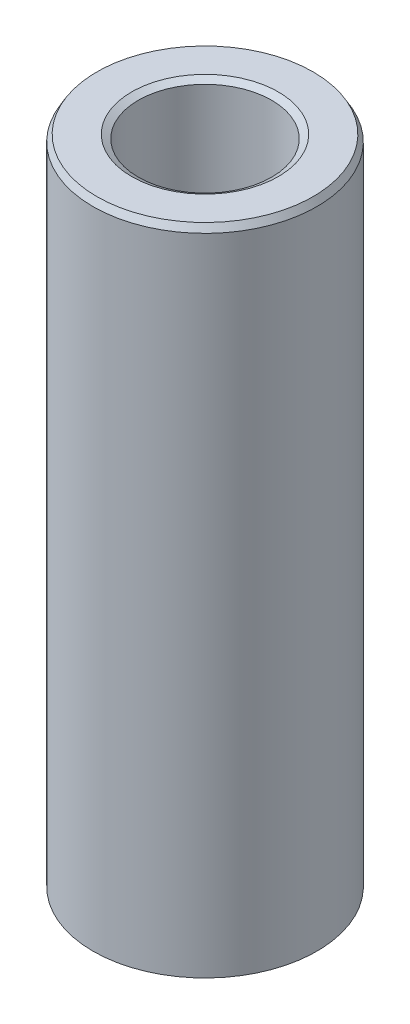
ISO-10303-21;
HEADER;
FILE_DESCRIPTION(('STEP AP214'),'2;1');
FILE_NAME('part.step','',(''),(''),'','','');
FILE_SCHEMA(('AUTOMOTIVE_DESIGN { 1 0 10303 214 1 1 1 1 }'));
ENDSEC;
DATA;
#1=APPLICATION_CONTEXT('core data for automotive mechanical design processes');
#2=APPLICATION_PROTOCOL_DEFINITION('international standard','automotive_design',2000,#1);
#3=PRODUCT_CONTEXT('',#1,'mechanical');
#4=PRODUCT('Part','Part','',(#3));
#5=PRODUCT_RELATED_PRODUCT_CATEGORY('part','',(#4));
#6=PRODUCT_DEFINITION_FORMATION('','',#4);
#7=PRODUCT_DEFINITION_CONTEXT('part definition',#1,'design');
#8=PRODUCT_DEFINITION('design','',#6,#7);
#9=PRODUCT_DEFINITION_SHAPE('','',#8);
#10=(LENGTH_UNIT() NAMED_UNIT(*) SI_UNIT(.MILLI.,.METRE.));
#11=(NAMED_UNIT(*) PLANE_ANGLE_UNIT() SI_UNIT($,.RADIAN.));
#12=(NAMED_UNIT(*) SI_UNIT($,.STERADIAN.) SOLID_ANGLE_UNIT());
#13=UNCERTAINTY_MEASURE_WITH_UNIT(LENGTH_MEASURE(1.E-05),#10,'distance_accuracy_value','');
#14=(GEOMETRIC_REPRESENTATION_CONTEXT(3) GLOBAL_UNCERTAINTY_ASSIGNED_CONTEXT((#13)) GLOBAL_UNIT_ASSIGNED_CONTEXT((#10,
#11,#12)) REPRESENTATION_CONTEXT('',''));
#15=CARTESIAN_POINT('',(0.,0.,0.));
#16=DIRECTION('',(0.,0.,1.));
#17=DIRECTION('',(1.,0.,0.));
#18=AXIS2_PLACEMENT_3D('',#15,#16,#17);
#19=CARTESIAN_POINT('',(0.,234.147937617198,0.));
#20=DIRECTION('',(0.,-1.,0.));
#21=DIRECTION('',(0.,0.,-1.));
#22=AXIS2_PLACEMENT_3D('',#19,#20,#21);
#23=CYLINDRICAL_SURFACE('',#22,40.);
#24=CARTESIAN_POINT('',(0.,1.38084321602647,0.));
#25=DIRECTION('',(0.,1.,0.));
#26=DIRECTION('',(0.,0.,1.));
#27=AXIS2_PLACEMENT_3D('',#24,#25,#26);
#28=CIRCLE('',#27,40.);
#29=CARTESIAN_POINT('',(0.,1.38084321602647,-40.));
#30=VERTEX_POINT('',#29);
#31=EDGE_CURVE('E10',#30,#30,#28,.T.);
#32=CARTESIAN_POINT('',(0.,231.756247009754,0.));
#33=DIRECTION('',(0.,1.,0.));
#34=DIRECTION('',(0.,0.,1.));
#35=AXIS2_PLACEMENT_3D('',#32,#33,#34);
#36=CIRCLE('',#35,40.);
#37=CARTESIAN_POINT('',(0.,231.756247009754,-40.));
#38=VERTEX_POINT('',#37);
#39=EDGE_CURVE('E50',#38,#38,#36,.F.);
#40=CARTESIAN_POINT('',(0.,1.38084321602647,-40.));
#41=CARTESIAN_POINT('',(0.,3.78058700554446,-40.));
#42=CARTESIAN_POINT('',(0.,6.18033079506246,-40.));
#43=CARTESIAN_POINT('',(0.,10.9798183740985,-40.));
#44=CARTESIAN_POINT('',(0.,13.3795621636165,-40.));
#45=CARTESIAN_POINT('',(0.,18.1790497426524,-40.));
#46=CARTESIAN_POINT('',(0.,20.5787935321704,-40.));
#47=CARTESIAN_POINT('',(0.,25.3782811112064,-40.));
#48=CARTESIAN_POINT('',(0.,27.7780249007244,-40.));
#49=CARTESIAN_POINT('',(0.,32.5775124797604,-40.));
#50=CARTESIAN_POINT('',(0.,34.9772562692784,-40.));
#51=CARTESIAN_POINT('',(0.,39.7767438483144,-40.));
#52=CARTESIAN_POINT('',(0.,42.1764876378324,-40.));
#53=CARTESIAN_POINT('',(0.,46.9759752168684,-40.));
#54=CARTESIAN_POINT('',(0.,49.3757190063864,-40.));
#55=CARTESIAN_POINT('',(0.,54.1752065854224,-40.));
#56=CARTESIAN_POINT('',(0.,56.5749503749404,-40.));
#57=CARTESIAN_POINT('',(0.,61.3744379539764,-40.));
#58=CARTESIAN_POINT('',(0.,63.7741817434943,-40.));
#59=CARTESIAN_POINT('',(0.,68.5736693225303,-40.));
#60=CARTESIAN_POINT('',(0.,70.9734131120483,-40.));
#61=CARTESIAN_POINT('',(0.,75.7729006910843,-40.));
#62=CARTESIAN_POINT('',(0.,78.1726444806023,-40.));
#63=CARTESIAN_POINT('',(0.,82.9721320596383,-40.));
#64=CARTESIAN_POINT('',(0.,85.3718758491563,-40.));
#65=CARTESIAN_POINT('',(0.,90.1713634281923,-40.));
#66=CARTESIAN_POINT('',(0.,92.5711072177103,-40.));
#67=CARTESIAN_POINT('',(0.,97.3705947967463,-40.));
#68=CARTESIAN_POINT('',(0.,99.7703385862643,-40.));
#69=CARTESIAN_POINT('',(0.,104.5698261653,-40.));
#70=CARTESIAN_POINT('',(0.,106.969569954818,-40.));
#71=CARTESIAN_POINT('',(0.,111.769057533854,-40.));
#72=CARTESIAN_POINT('',(0.,114.168801323372,-40.));
#73=CARTESIAN_POINT('',(0.,118.968288902408,-40.));
#74=CARTESIAN_POINT('',(0.,121.368032691926,-40.));
#75=CARTESIAN_POINT('',(0.,126.167520270962,-40.));
#76=CARTESIAN_POINT('',(0.,128.56726406048,-40.));
#77=CARTESIAN_POINT('',(0.,133.366751639516,-40.));
#78=CARTESIAN_POINT('',(0.,135.766495429034,-40.));
#79=CARTESIAN_POINT('',(0.,140.56598300807,-40.));
#80=CARTESIAN_POINT('',(0.,142.965726797588,-40.));
#81=CARTESIAN_POINT('',(0.,147.765214376624,-40.));
#82=CARTESIAN_POINT('',(0.,150.164958166142,-40.));
#83=CARTESIAN_POINT('',(0.,154.964445745178,-40.));
#84=CARTESIAN_POINT('',(0.,157.364189534696,-40.));
#85=CARTESIAN_POINT('',(0.,162.163677113732,-40.));
#86=CARTESIAN_POINT('',(0.,164.56342090325,-40.));
#87=CARTESIAN_POINT('',(0.,169.362908482286,-40.));
#88=CARTESIAN_POINT('',(0.,171.762652271804,-40.));
#89=CARTESIAN_POINT('',(0.,176.56213985084,-40.));
#90=CARTESIAN_POINT('',(0.,178.961883640358,-40.));
#91=CARTESIAN_POINT('',(0.,183.761371219394,-40.));
#92=CARTESIAN_POINT('',(0.,186.161115008912,-40.));
#93=CARTESIAN_POINT('',(0.,190.960602587948,-40.));
#94=CARTESIAN_POINT('',(0.,193.360346377466,-40.));
#95=CARTESIAN_POINT('',(0.,198.159833956502,-40.));
#96=CARTESIAN_POINT('',(0.,200.55957774602,-40.));
#97=CARTESIAN_POINT('',(0.,205.359065325056,-40.));
#98=CARTESIAN_POINT('',(0.,207.758809114574,-40.));
#99=CARTESIAN_POINT('',(0.,212.55829669361,-40.));
#100=CARTESIAN_POINT('',(0.,214.958040483128,-40.));
#101=CARTESIAN_POINT('',(0.,219.757528062164,-40.));
#102=CARTESIAN_POINT('',(0.,222.157271851682,-40.));
#103=CARTESIAN_POINT('',(0.,226.956759430718,-40.));
#104=CARTESIAN_POINT('',(0.,229.356503220236,-40.));
#105=CARTESIAN_POINT('',(0.,231.756247009754,-40.));
#106=B_SPLINE_CURVE_WITH_KNOTS('',3,(#40,#41,#42,#43,#44,#45,#46,#47,#48,#49,#50,#51,#52,#53,
#54,#55,#56,#57,#58,#59,#60,#61,#62,#63,#64,#65,#66,#67,#68,#69,#70,#71,#72,#73,#74,#75,#76,#77,
#78,#79,#80,#81,#82,#83,#84,#85,#86,#87,#88,#89,#90,#91,#92,#93,#94,#95,#96,#97,#98,#99,#100,
#101,#102,#103,#104,#105),.UNSPECIFIED.,.F.,.F.,(4,2,2,2,2,2,2,2,2,2,2,2,2,2,2,2,2,2,2,2,2,2,2,
2,2,2,2,2,2,2,2,2,4),(0.,7.19923136855399,14.398462737108,21.597694105662,28.7969254742159,
35.9961568427699,43.1953882113239,50.3946195798779,57.5938509484319,64.7930823169859,
71.9923136855399,79.1915450540939,86.3907764226479,93.5900077912018,100.789239159756,
107.98847052831,115.187701896864,122.386933265418,129.586164633972,136.785396002526,
143.98462737108,151.183858739634,158.383090108188,165.582321476742,172.781552845296,
179.98078421385,187.180015582404,194.379246950958,201.578478319512,208.777709688066,
215.97694105662,223.176172425174,230.375403793728),.UNSPECIFIED.);
#107=EDGE_CURVE('BSEAM39',#30,#38,#106,.T.);
#108=ORIENTED_EDGE('',*,*,#31,.T.);
#109=ORIENTED_EDGE('',*,*,#39,.T.);
#110=ORIENTED_EDGE('',*,*,#107,.T.);
#111=ORIENTED_EDGE('',*,*,#107,.F.);
#112=EDGE_LOOP('',(#108,#110,#109,#111));
#113=FACE_BOUND('',#112,.T.);
#114=ADVANCED_FACE('F39',(#113),#23,.T.);
#115=CARTESIAN_POINT('',(0.,234.147937617198,0.));
#116=DIRECTION('',(0.,1.,0.));
#117=DIRECTION('',(0.,0.,1.));
#118=AXIS2_PLACEMENT_3D('',#115,#116,#117);
#119=PLANE('',#118);
#120=CARTESIAN_POINT('',(0.,234.147937617198,0.));
#121=DIRECTION('',(0.,1.,0.));
#122=DIRECTION('',(0.,0.,1.));
#123=AXIS2_PLACEMENT_3D('',#120,#121,#122);
#124=CIRCLE('',#123,26.2113574897358);
#125=CARTESIAN_POINT('',(0.,234.147937617198,26.2113574897358));
#126=VERTEX_POINT('',#125);
#127=EDGE_CURVE('E58',#126,#126,#124,.F.);
#128=ORIENTED_EDGE('',*,*,#127,.T.);
#129=EDGE_LOOP('',(#128));
#130=FACE_BOUND('',#129,.T.);
#131=CARTESIAN_POINT('',(0.,234.147937617198,0.));
#132=DIRECTION('',(0.,1.,0.));
#133=DIRECTION('',(0.,0.,1.));
#134=AXIS2_PLACEMENT_3D('',#131,#132,#133);
#135=CIRCLE('',#134,38.6191567839737);
#136=CARTESIAN_POINT('',(0.,234.147937617198,38.6191567839737));
#137=VERTEX_POINT('',#136);
#138=EDGE_CURVE('E61',#137,#137,#135,.T.);
#139=ORIENTED_EDGE('',*,*,#138,.T.);
#140=EDGE_LOOP('',(#139));
#141=FACE_BOUND('',#140,.T.);
#142=ADVANCED_FACE('F88',(#130,#141),#119,.T.);
#143=CARTESIAN_POINT('',(0.,0.,0.));
#144=DIRECTION('',(0.,1.,0.));
#145=DIRECTION('',(0.,0.,1.));
#146=AXIS2_PLACEMENT_3D('',#143,#144,#145);
#147=PLANE('',#146);
#148=CARTESIAN_POINT('',(0.,0.,0.));
#149=DIRECTION('',(0.,1.,0.));
#150=DIRECTION('',(0.,0.,1.));
#151=AXIS2_PLACEMENT_3D('',#148,#149,#150);
#152=CIRCLE('',#151,25.2005100983176);
#153=CARTESIAN_POINT('',(0.,0.,25.2005100983176));
#154=VERTEX_POINT('',#153);
#155=EDGE_CURVE('E51',#154,#154,#152,.T.);
#156=ORIENTED_EDGE('',*,*,#155,.T.);
#157=EDGE_LOOP('',(#156));
#158=FACE_BOUND('',#157,.T.);
#159=CARTESIAN_POINT('',(0.,0.,0.));
#160=DIRECTION('',(0.,1.,0.));
#161=DIRECTION('',(0.,0.,1.));
#162=AXIS2_PLACEMENT_3D('',#159,#160,#161);
#163=CIRCLE('',#162,37.6083093925553);
#164=CARTESIAN_POINT('',(0.,0.,37.6083093925553));
#165=VERTEX_POINT('',#164);
#166=EDGE_CURVE('E54',#165,#165,#163,.F.);
#167=ORIENTED_EDGE('',*,*,#166,.T.);
#168=EDGE_LOOP('',(#167));
#169=FACE_BOUND('',#168,.T.);
#170=ADVANCED_FACE('F83',(#158,#169),#147,.F.);
#171=CARTESIAN_POINT('',(0.,234.147937617198,0.));
#172=DIRECTION('',(0.,-1.,0.));
#173=DIRECTION('',(0.,0.,-1.));
#174=AXIS2_PLACEMENT_3D('',#171,#172,#173);
#175=CYLINDRICAL_SURFACE('',#174,23.8196668822913);
#176=CARTESIAN_POINT('',(0.,232.767094401172,0.));
#177=DIRECTION('',(0.,1.,0.));
#178=DIRECTION('',(0.,0.,1.));
#179=AXIS2_PLACEMENT_3D('',#176,#177,#178);
#180=CIRCLE('',#179,23.8196668822913);
#181=CARTESIAN_POINT('',(0.,232.767094401172,-23.8196668822913));
#182=VERTEX_POINT('',#181);
#183=EDGE_CURVE('E67',#182,#182,#180,.T.);
#184=CARTESIAN_POINT('',(0.,2.39169060744451,0.));
#185=DIRECTION('',(0.,1.,0.));
#186=DIRECTION('',(0.,0.,1.));
#187=AXIS2_PLACEMENT_3D('',#184,#185,#186);
#188=CIRCLE('',#187,23.8196668822913);
#189=CARTESIAN_POINT('',(0.,2.39169060744451,-23.8196668822913));
#190=VERTEX_POINT('',#189);
#191=EDGE_CURVE('E69',#190,#190,#188,.F.);
#192=CARTESIAN_POINT('',(0.,232.767094401172,-23.8196668822913));
#193=CARTESIAN_POINT('',(0.,230.367350611654,-23.8196668822913));
#194=CARTESIAN_POINT('',(0.,227.967606822136,-23.8196668822913));
#195=CARTESIAN_POINT('',(0.,223.1681192431,-23.8196668822913));
#196=CARTESIAN_POINT('',(0.,220.768375453582,-23.8196668822913));
#197=CARTESIAN_POINT('',(0.,215.968887874546,-23.8196668822913));
#198=CARTESIAN_POINT('',(0.,213.569144085028,-23.8196668822913));
#199=CARTESIAN_POINT('',(0.,208.769656505992,-23.8196668822913));
#200=CARTESIAN_POINT('',(0.,206.369912716474,-23.8196668822913));
#201=CARTESIAN_POINT('',(0.,201.570425137438,-23.8196668822913));
#202=CARTESIAN_POINT('',(0.,199.17068134792,-23.8196668822913));
#203=CARTESIAN_POINT('',(0.,194.371193768884,-23.8196668822913));
#204=CARTESIAN_POINT('',(0.,191.971449979366,-23.8196668822913));
#205=CARTESIAN_POINT('',(0.,187.17196240033,-23.8196668822913));
#206=CARTESIAN_POINT('',(0.,184.772218610812,-23.8196668822913));
#207=CARTESIAN_POINT('',(0.,179.972731031776,-23.8196668822913));
#208=CARTESIAN_POINT('',(0.,177.572987242258,-23.8196668822913));
#209=CARTESIAN_POINT('',(0.,172.773499663222,-23.8196668822913));
#210=CARTESIAN_POINT('',(0.,170.373755873704,-23.8196668822913));
#211=CARTESIAN_POINT('',(0.,165.574268294668,-23.8196668822913));
#212=CARTESIAN_POINT('',(0.,163.17452450515,-23.8196668822913));
#213=CARTESIAN_POINT('',(0.,158.375036926114,-23.8196668822913));
#214=CARTESIAN_POINT('',(0.,155.975293136596,-23.8196668822913));
#215=CARTESIAN_POINT('',(0.,151.17580555756,-23.8196668822913));
#216=CARTESIAN_POINT('',(0.,148.776061768042,-23.8196668822913));
#217=CARTESIAN_POINT('',(0.,143.976574189006,-23.8196668822913));
#218=CARTESIAN_POINT('',(0.,141.576830399488,-23.8196668822913));
#219=CARTESIAN_POINT('',(0.,136.777342820452,-23.8196668822913));
#220=CARTESIAN_POINT('',(0.,134.377599030934,-23.8196668822913));
#221=CARTESIAN_POINT('',(0.,129.578111451898,-23.8196668822913));
#222=CARTESIAN_POINT('',(0.,127.17836766238,-23.8196668822913));
#223=CARTESIAN_POINT('',(0.,122.378880083344,-23.8196668822913));
#224=CARTESIAN_POINT('',(0.,119.979136293826,-23.8196668822913));
#225=CARTESIAN_POINT('',(0.,115.17964871479,-23.8196668822913));
#226=CARTESIAN_POINT('',(0.,112.779904925272,-23.8196668822913));
#227=CARTESIAN_POINT('',(0.,107.980417346236,-23.8196668822913));
#228=CARTESIAN_POINT('',(0.,105.580673556718,-23.8196668822913));
#229=CARTESIAN_POINT('',(0.,100.781185977682,-23.8196668822913));
#230=CARTESIAN_POINT('',(0.,98.3814421881643,-23.8196668822913));
#231=CARTESIAN_POINT('',(0.,93.5819546091284,-23.8196668822913));
#232=CARTESIAN_POINT('',(0.,91.1822108196104,-23.8196668822913));
#233=CARTESIAN_POINT('',(0.,86.3827232405744,-23.8196668822913));
#234=CARTESIAN_POINT('',(0.,83.9829794510564,-23.8196668822913));
#235=CARTESIAN_POINT('',(0.,79.1834918720204,-23.8196668822913));
#236=CARTESIAN_POINT('',(0.,76.7837480825024,-23.8196668822913));
#237=CARTESIAN_POINT('',(0.,71.9842605034664,-23.8196668822913));
#238=CARTESIAN_POINT('',(0.,69.5845167139484,-23.8196668822913));
#239=CARTESIAN_POINT('',(0.,64.7850291349124,-23.8196668822913));
#240=CARTESIAN_POINT('',(0.,62.3852853453944,-23.8196668822913));
#241=CARTESIAN_POINT('',(0.,57.5857977663584,-23.8196668822913));
#242=CARTESIAN_POINT('',(0.,55.1860539768404,-23.8196668822913));
#243=CARTESIAN_POINT('',(0.,50.3865663978044,-23.8196668822913));
#244=CARTESIAN_POINT('',(0.,47.9868226082864,-23.8196668822913));
#245=CARTESIAN_POINT('',(0.,43.1873350292504,-23.8196668822913));
#246=CARTESIAN_POINT('',(0.,40.7875912397325,-23.8196668822913));
#247=CARTESIAN_POINT('',(0.,35.9881036606965,-23.8196668822913));
#248=CARTESIAN_POINT('',(0.,33.5883598711785,-23.8196668822913));
#249=CARTESIAN_POINT('',(0.,28.7888722921425,-23.8196668822913));
#250=CARTESIAN_POINT('',(0.,26.3891285026245,-23.8196668822913));
#251=CARTESIAN_POINT('',(0.,21.5896409235885,-23.8196668822913));
#252=CARTESIAN_POINT('',(0.,19.1898971340705,-23.8196668822913));
#253=CARTESIAN_POINT('',(0.,14.3904095550345,-23.8196668822913));
#254=CARTESIAN_POINT('',(0.,11.9906657655165,-23.8196668822913));
#255=CARTESIAN_POINT('',(0.,7.19117818648051,-23.8196668822913));
#256=CARTESIAN_POINT('',(0.,4.79143439696251,-23.8196668822913));
#257=CARTESIAN_POINT('',(0.,2.39169060744451,-23.8196668822913));
#258=B_SPLINE_CURVE_WITH_KNOTS('',3,(#192,#193,#194,#195,#196,#197,#198,#199,#200,#201,#202,
#203,#204,#205,#206,#207,#208,#209,#210,#211,#212,#213,#214,#215,#216,#217,#218,#219,#220,#221,
#222,#223,#224,#225,#226,#227,#228,#229,#230,#231,#232,#233,#234,#235,#236,#237,#238,#239,#240,
#241,#242,#243,#244,#245,#246,#247,#248,#249,#250,#251,#252,#253,#254,#255,#256,#257),
.UNSPECIFIED.,.F.,.F.,(4,2,2,2,2,2,2,2,2,2,2,2,2,2,2,2,2,2,2,2,2,2,2,2,2,2,2,2,2,2,2,2,4),(0.,
7.19923136855399,14.398462737108,21.597694105662,28.7969254742159,35.9961568427699,
43.1953882113239,50.3946195798779,57.5938509484319,64.7930823169859,71.9923136855399,
79.1915450540938,86.3907764226478,93.5900077912018,100.789239159756,107.98847052831,
115.187701896864,122.386933265418,129.586164633972,136.785396002526,143.98462737108,
151.183858739634,158.383090108188,165.582321476742,172.781552845296,179.98078421385,
187.180015582404,194.379246950958,201.578478319512,208.777709688066,215.97694105662,
223.176172425174,230.375403793728),.UNSPECIFIED.);
#259=EDGE_CURVE('BSEAM71',#182,#190,#258,.T.);
#260=ORIENTED_EDGE('',*,*,#183,.T.);
#261=ORIENTED_EDGE('',*,*,#191,.T.);
#262=ORIENTED_EDGE('',*,*,#259,.T.);
#263=ORIENTED_EDGE('',*,*,#259,.F.);
#264=EDGE_LOOP('',(#260,#262,#261,#263));
#265=FACE_BOUND('',#264,.T.);
#266=ADVANCED_FACE('F71',(#265),#175,.F.);
#267=CARTESIAN_POINT('',(0.,232.767094401172,0.));
#268=DIRECTION('',(0.,1.,0.));
#269=DIRECTION('',(0.,0.,1.));
#270=AXIS2_PLACEMENT_3D('',#267,#268,#269);
#271=CONICAL_SURFACE('',#270,23.8196668822913,1.0471975511966);
#272=ORIENTED_EDGE('',*,*,#127,.F.);
#273=EDGE_LOOP('',(#272));
#274=FACE_BOUND('',#273,.T.);
#275=ORIENTED_EDGE('',*,*,#183,.F.);
#276=EDGE_LOOP('',(#275));
#277=FACE_BOUND('',#276,.T.);
#278=ADVANCED_FACE('F77',(#274,#277),#271,.F.);
#279=CARTESIAN_POINT('',(0.,0.,0.));
#280=DIRECTION('',(0.,-1.,0.));
#281=DIRECTION('',(0.,0.,-1.));
#282=AXIS2_PLACEMENT_3D('',#279,#280,#281);
#283=CONICAL_SURFACE('',#282,25.2005100983176,0.523598775598292);
#284=ORIENTED_EDGE('',*,*,#191,.F.);
#285=EDGE_LOOP('',(#284));
#286=FACE_BOUND('',#285,.T.);
#287=ORIENTED_EDGE('',*,*,#155,.F.);
#288=EDGE_LOOP('',(#287));
#289=FACE_BOUND('',#288,.T.);
#290=ADVANCED_FACE('F73',(#286,#289),#283,.F.);
#291=CARTESIAN_POINT('',(0.,1.38084321602647,0.));
#292=DIRECTION('',(0.,1.,0.));
#293=DIRECTION('',(0.,0.,1.));
#294=AXIS2_PLACEMENT_3D('',#291,#292,#293);
#295=CONICAL_SURFACE('',#294,40.,1.0471975511966);
#296=ORIENTED_EDGE('',*,*,#166,.F.);
#297=EDGE_LOOP('',(#296));
#298=FACE_BOUND('',#297,.T.);
#299=ORIENTED_EDGE('',*,*,#31,.F.);
#300=EDGE_LOOP('',(#299));
#301=FACE_BOUND('',#300,.T.);
#302=ADVANCED_FACE('F76',(#298,#301),#295,.T.);
#303=CARTESIAN_POINT('',(0.,234.147937617198,0.));
#304=DIRECTION('',(0.,-1.,0.));
#305=DIRECTION('',(0.,0.,-1.));
#306=AXIS2_PLACEMENT_3D('',#303,#304,#305);
#307=CONICAL_SURFACE('',#306,38.6191567839737,0.523598775598286);
#308=ORIENTED_EDGE('',*,*,#39,.F.);
#309=EDGE_LOOP('',(#308));
#310=FACE_BOUND('',#309,.T.);
#311=ORIENTED_EDGE('',*,*,#138,.F.);
#312=EDGE_LOOP('',(#311));
#313=FACE_BOUND('',#312,.T.);
#314=ADVANCED_FACE('F45',(#310,#313),#307,.T.);
#315=CLOSED_SHELL('',(#114,#142,#170,#266,#278,#290,#302,#314));
#316=MANIFOLD_SOLID_BREP('B2',#315);
#317=ADVANCED_BREP_SHAPE_REPRESENTATION('',(#18,#316),#14);
#318=SHAPE_DEFINITION_REPRESENTATION(#9,#317);
ENDSEC;
END-ISO-10303-21;
